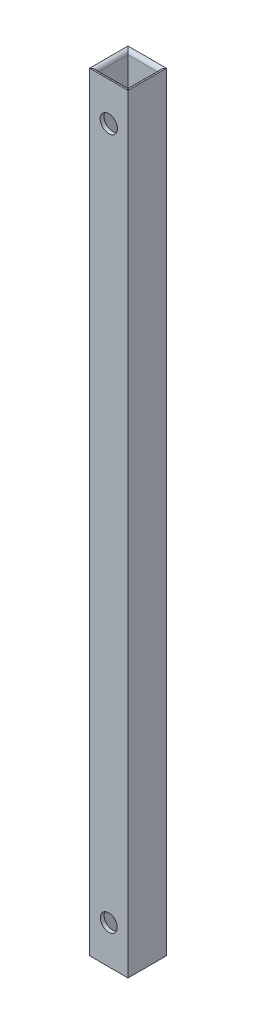
ISO-10303-21;
HEADER;
FILE_DESCRIPTION(('STEP AP214'),'2;1');
FILE_NAME('part.step','',(''),(''),'','','');
FILE_SCHEMA(('AUTOMOTIVE_DESIGN { 1 0 10303 214 1 1 1 1 }'));
ENDSEC;
DATA;
#1=APPLICATION_CONTEXT('core data for automotive mechanical design processes');
#2=APPLICATION_PROTOCOL_DEFINITION('international standard','automotive_design',2000,#1);
#3=PRODUCT_CONTEXT('',#1,'mechanical');
#4=PRODUCT('Part','Part','',(#3));
#5=PRODUCT_RELATED_PRODUCT_CATEGORY('part','',(#4));
#6=PRODUCT_DEFINITION_FORMATION('','',#4);
#7=PRODUCT_DEFINITION_CONTEXT('part definition',#1,'design');
#8=PRODUCT_DEFINITION('design','',#6,#7);
#9=PRODUCT_DEFINITION_SHAPE('','',#8);
#10=(LENGTH_UNIT() NAMED_UNIT(*) SI_UNIT(.MILLI.,.METRE.));
#11=(NAMED_UNIT(*) PLANE_ANGLE_UNIT() SI_UNIT($,.RADIAN.));
#12=(NAMED_UNIT(*) SI_UNIT($,.STERADIAN.) SOLID_ANGLE_UNIT());
#13=UNCERTAINTY_MEASURE_WITH_UNIT(LENGTH_MEASURE(1.E-05),#10,'distance_accuracy_value','');
#14=(GEOMETRIC_REPRESENTATION_CONTEXT(3) GLOBAL_UNCERTAINTY_ASSIGNED_CONTEXT((#13)) GLOBAL_UNIT_ASSIGNED_CONTEXT((#10,
#11,#12)) REPRESENTATION_CONTEXT('',''));
#15=CARTESIAN_POINT('',(0.,0.,0.));
#16=DIRECTION('',(0.,0.,1.));
#17=DIRECTION('',(1.,0.,0.));
#18=AXIS2_PLACEMENT_3D('',#15,#16,#17);
#19=CARTESIAN_POINT('',(5.,200.,-5.));
#20=DIRECTION('',(-1.,0.,0.));
#21=DIRECTION('',(0.,0.,1.));
#22=AXIS2_PLACEMENT_3D('',#19,#20,#21);
#23=PLANE('',#22);
#24=DIRECTION('',(0.,0.,-1.));
#25=VECTOR('',#24,1.);
#26=CARTESIAN_POINT('',(5.,0.,-5.));
#27=LINE('',#26,#25);
#28=CARTESIAN_POINT('',(5.,0.,5.));
#29=VERTEX_POINT('',#28);
#30=CARTESIAN_POINT('',(5.,0.,-5.));
#31=VERTEX_POINT('',#30);
#32=EDGE_CURVE('E122',#29,#31,#27,.T.);
#33=ORIENTED_EDGE('',*,*,#32,.T.);
#34=DIRECTION('',(0.,-1.,0.));
#35=VECTOR('',#34,1.);
#36=CARTESIAN_POINT('',(5.,200.,-5.));
#37=LINE('',#36,#35);
#38=CARTESIAN_POINT('',(5.,200.,-5.));
#39=VERTEX_POINT('',#38);
#40=EDGE_CURVE('E108',#39,#31,#37,.T.);
#41=ORIENTED_EDGE('',*,*,#40,.F.);
#42=DIRECTION('',(0.,0.,-1.));
#43=VECTOR('',#42,1.);
#44=CARTESIAN_POINT('',(5.,200.,-5.));
#45=LINE('',#44,#43);
#46=CARTESIAN_POINT('',(5.,200.,5.));
#47=VERTEX_POINT('',#46);
#48=EDGE_CURVE('E116',#47,#39,#45,.T.);
#49=ORIENTED_EDGE('',*,*,#48,.F.);
#50=DIRECTION('',(0.,-1.,0.));
#51=VECTOR('',#50,1.);
#52=CARTESIAN_POINT('',(5.,200.,5.));
#53=LINE('',#52,#51);
#54=EDGE_CURVE('E184',#47,#29,#53,.T.);
#55=ORIENTED_EDGE('',*,*,#54,.T.);
#56=EDGE_LOOP('',(#33,#41,#49,#55));
#57=FACE_BOUND('',#56,.T.);
#58=ADVANCED_FACE('F37',(#57),#23,.F.);
#59=CARTESIAN_POINT('',(-5.,200.,-5.));
#60=DIRECTION('',(0.,0.,1.));
#61=DIRECTION('',(1.,0.,0.));
#62=AXIS2_PLACEMENT_3D('',#59,#60,#61);
#63=PLANE('',#62);
#64=CARTESIAN_POINT('',(0.,10.,-5.));
#65=DIRECTION('',(0.,0.,1.));
#66=DIRECTION('',(1.,0.,0.));
#67=AXIS2_PLACEMENT_3D('',#64,#65,#66);
#68=CIRCLE('',#67,2.2);
#69=CARTESIAN_POINT('',(2.2,10.,-5.));
#70=VERTEX_POINT('',#69);
#71=EDGE_CURVE('E151',#70,#70,#68,.T.);
#72=ORIENTED_EDGE('',*,*,#71,.T.);
#73=EDGE_LOOP('',(#72));
#74=FACE_BOUND('',#73,.T.);
#75=CARTESIAN_POINT('',(0.,190.,-5.));
#76=DIRECTION('',(0.,0.,1.));
#77=DIRECTION('',(1.,0.,0.));
#78=AXIS2_PLACEMENT_3D('',#75,#76,#77);
#79=CIRCLE('',#78,2.25);
#80=CARTESIAN_POINT('',(2.25,190.,-5.));
#81=VERTEX_POINT('',#80);
#82=EDGE_CURVE('E167',#81,#81,#79,.T.);
#83=ORIENTED_EDGE('',*,*,#82,.T.);
#84=EDGE_LOOP('',(#83));
#85=FACE_BOUND('',#84,.T.);
#86=DIRECTION('',(-1.,0.,0.));
#87=VECTOR('',#86,1.);
#88=CARTESIAN_POINT('',(-5.,0.,-5.));
#89=LINE('',#88,#87);
#90=CARTESIAN_POINT('',(-5.,0.,-5.));
#91=VERTEX_POINT('',#90);
#92=EDGE_CURVE('E186',#31,#91,#89,.T.);
#93=ORIENTED_EDGE('',*,*,#92,.T.);
#94=DIRECTION('',(0.,-1.,0.));
#95=VECTOR('',#94,1.);
#96=CARTESIAN_POINT('',(-5.,200.,-5.));
#97=LINE('',#96,#95);
#98=CARTESIAN_POINT('',(-5.,200.,-5.));
#99=VERTEX_POINT('',#98);
#100=EDGE_CURVE('E111',#99,#91,#97,.T.);
#101=ORIENTED_EDGE('',*,*,#100,.F.);
#102=DIRECTION('',(-1.,0.,0.));
#103=VECTOR('',#102,1.);
#104=CARTESIAN_POINT('',(-5.,200.,-5.));
#105=LINE('',#104,#103);
#106=EDGE_CURVE('E105',#39,#99,#105,.T.);
#107=ORIENTED_EDGE('',*,*,#106,.F.);
#108=ORIENTED_EDGE('',*,*,#40,.T.);
#109=EDGE_LOOP('',(#93,#101,#107,#108));
#110=FACE_BOUND('',#109,.T.);
#111=ADVANCED_FACE('F107',(#74,#85,#110),#63,.F.);
#112=CARTESIAN_POINT('',(-5.,200.,-5.));
#113=DIRECTION('',(1.,0.,0.));
#114=DIRECTION('',(0.,0.,-1.));
#115=AXIS2_PLACEMENT_3D('',#112,#113,#114);
#116=PLANE('',#115);
#117=DIRECTION('',(0.,0.,1.));
#118=VECTOR('',#117,1.);
#119=CARTESIAN_POINT('',(-5.,0.,-5.));
#120=LINE('',#119,#118);
#121=CARTESIAN_POINT('',(-5.,0.,5.));
#122=VERTEX_POINT('',#121);
#123=EDGE_CURVE('E188',#91,#122,#120,.T.);
#124=ORIENTED_EDGE('',*,*,#123,.T.);
#125=DIRECTION('',(0.,-1.,0.));
#126=VECTOR('',#125,1.);
#127=CARTESIAN_POINT('',(-5.,200.,5.));
#128=LINE('',#127,#126);
#129=CARTESIAN_POINT('',(-5.,200.,5.));
#130=VERTEX_POINT('',#129);
#131=EDGE_CURVE('E193',#130,#122,#128,.T.);
#132=ORIENTED_EDGE('',*,*,#131,.F.);
#133=DIRECTION('',(0.,0.,1.));
#134=VECTOR('',#133,1.);
#135=CARTESIAN_POINT('',(-5.,200.,-5.));
#136=LINE('',#135,#134);
#137=EDGE_CURVE('E115',#99,#130,#136,.T.);
#138=ORIENTED_EDGE('',*,*,#137,.F.);
#139=ORIENTED_EDGE('',*,*,#100,.T.);
#140=EDGE_LOOP('',(#124,#132,#138,#139));
#141=FACE_BOUND('',#140,.T.);
#142=ADVANCED_FACE('F247',(#141),#116,.F.);
#143=CARTESIAN_POINT('',(-5.,200.,5.));
#144=DIRECTION('',(0.,0.,-1.));
#145=DIRECTION('',(-1.,0.,0.));
#146=AXIS2_PLACEMENT_3D('',#143,#144,#145);
#147=PLANE('',#146);
#148=CARTESIAN_POINT('',(0.,10.,5.));
#149=DIRECTION('',(0.,0.,1.));
#150=DIRECTION('',(1.,0.,0.));
#151=AXIS2_PLACEMENT_3D('',#148,#149,#150);
#152=CIRCLE('',#151,2.2);
#153=CARTESIAN_POINT('',(2.2,10.,5.));
#154=VERTEX_POINT('',#153);
#155=EDGE_CURVE('E157',#154,#154,#152,.T.);
#156=ORIENTED_EDGE('',*,*,#155,.F.);
#157=EDGE_LOOP('',(#156));
#158=FACE_BOUND('',#157,.T.);
#159=CARTESIAN_POINT('',(0.,190.,5.));
#160=DIRECTION('',(0.,0.,1.));
#161=DIRECTION('',(1.,0.,0.));
#162=AXIS2_PLACEMENT_3D('',#159,#160,#161);
#163=CIRCLE('',#162,2.25);
#164=CARTESIAN_POINT('',(2.25,190.,5.));
#165=VERTEX_POINT('',#164);
#166=EDGE_CURVE('E162',#165,#165,#163,.T.);
#167=ORIENTED_EDGE('',*,*,#166,.F.);
#168=EDGE_LOOP('',(#167));
#169=FACE_BOUND('',#168,.T.);
#170=DIRECTION('',(1.,0.,0.));
#171=VECTOR('',#170,1.);
#172=CARTESIAN_POINT('',(-5.,0.,5.));
#173=LINE('',#172,#171);
#174=EDGE_CURVE('E130',#122,#29,#173,.T.);
#175=ORIENTED_EDGE('',*,*,#174,.T.);
#176=ORIENTED_EDGE('',*,*,#54,.F.);
#177=DIRECTION('',(1.,0.,0.));
#178=VECTOR('',#177,1.);
#179=CARTESIAN_POINT('',(-5.,200.,5.));
#180=LINE('',#179,#178);
#181=EDGE_CURVE('E182',#130,#47,#180,.T.);
#182=ORIENTED_EDGE('',*,*,#181,.F.);
#183=ORIENTED_EDGE('',*,*,#131,.T.);
#184=EDGE_LOOP('',(#175,#176,#182,#183));
#185=FACE_BOUND('',#184,.T.);
#186=ADVANCED_FACE('F250',(#158,#169,#185),#147,.F.);
#187=CARTESIAN_POINT('',(4.,200.,-4.));
#188=DIRECTION('',(-1.,0.,0.));
#189=DIRECTION('',(0.,0.,1.));
#190=AXIS2_PLACEMENT_3D('',#187,#188,#189);
#191=PLANE('',#190);
#192=DIRECTION('',(0.,-1.,0.));
#193=VECTOR('',#192,1.);
#194=CARTESIAN_POINT('',(4.,200.,-4.));
#195=LINE('',#194,#193);
#196=CARTESIAN_POINT('',(4.,199.,-4.));
#197=VERTEX_POINT('',#196);
#198=CARTESIAN_POINT('',(4.,1.,-4.));
#199=VERTEX_POINT('',#198);
#200=EDGE_CURVE('E178',#197,#199,#195,.T.);
#201=ORIENTED_EDGE('',*,*,#200,.T.);
#202=DIRECTION('',(0.,0.,-1.));
#203=VECTOR('',#202,1.);
#204=CARTESIAN_POINT('',(4.,1.,4.));
#205=LINE('',#204,#203);
#206=CARTESIAN_POINT('',(4.,1.,4.));
#207=VERTEX_POINT('',#206);
#208=EDGE_CURVE('E207',#199,#207,#205,.F.);
#209=ORIENTED_EDGE('',*,*,#208,.T.);
#210=DIRECTION('',(0.,-1.,0.));
#211=VECTOR('',#210,1.);
#212=CARTESIAN_POINT('',(4.,200.,4.));
#213=LINE('',#212,#211);
#214=CARTESIAN_POINT('',(4.,199.,4.));
#215=VERTEX_POINT('',#214);
#216=EDGE_CURVE('E170',#215,#207,#213,.T.);
#217=ORIENTED_EDGE('',*,*,#216,.F.);
#218=DIRECTION('',(0.,0.,-1.));
#219=VECTOR('',#218,1.);
#220=CARTESIAN_POINT('',(4.,199.,-4.));
#221=LINE('',#220,#219);
#222=EDGE_CURVE('E205',#215,#197,#221,.T.);
#223=ORIENTED_EDGE('',*,*,#222,.T.);
#224=EDGE_LOOP('',(#201,#209,#217,#223));
#225=FACE_BOUND('',#224,.T.);
#226=ADVANCED_FACE('F228',(#225),#191,.T.);
#227=CARTESIAN_POINT('',(-4.,200.,-4.));
#228=DIRECTION('',(0.,0.,1.));
#229=DIRECTION('',(1.,0.,0.));
#230=AXIS2_PLACEMENT_3D('',#227,#228,#229);
#231=PLANE('',#230);
#232=CARTESIAN_POINT('',(0.,10.,-4.));
#233=DIRECTION('',(0.,0.,1.));
#234=DIRECTION('',(1.,0.,0.));
#235=AXIS2_PLACEMENT_3D('',#232,#233,#234);
#236=CIRCLE('',#235,2.2);
#237=CARTESIAN_POINT('',(2.2,10.,-4.));
#238=VERTEX_POINT('',#237);
#239=EDGE_CURVE('E134',#238,#238,#236,.T.);
#240=ORIENTED_EDGE('',*,*,#239,.F.);
#241=EDGE_LOOP('',(#240));
#242=FACE_BOUND('',#241,.T.);
#243=CARTESIAN_POINT('',(0.,190.,-4.));
#244=DIRECTION('',(0.,0.,1.));
#245=DIRECTION('',(1.,0.,0.));
#246=AXIS2_PLACEMENT_3D('',#243,#244,#245);
#247=CIRCLE('',#246,2.25);
#248=CARTESIAN_POINT('',(2.25,190.,-4.));
#249=VERTEX_POINT('',#248);
#250=EDGE_CURVE('E150',#249,#249,#247,.T.);
#251=ORIENTED_EDGE('',*,*,#250,.F.);
#252=EDGE_LOOP('',(#251));
#253=FACE_BOUND('',#252,.T.);
#254=DIRECTION('',(0.,-1.,0.));
#255=VECTOR('',#254,1.);
#256=CARTESIAN_POINT('',(-4.,200.,-4.));
#257=LINE('',#256,#255);
#258=CARTESIAN_POINT('',(-4.,199.,-4.));
#259=VERTEX_POINT('',#258);
#260=CARTESIAN_POINT('',(-4.,1.,-4.));
#261=VERTEX_POINT('',#260);
#262=EDGE_CURVE('E176',#259,#261,#257,.T.);
#263=ORIENTED_EDGE('',*,*,#262,.T.);
#264=DIRECTION('',(-1.,0.,0.));
#265=VECTOR('',#264,1.);
#266=CARTESIAN_POINT('',(4.,1.,-4.));
#267=LINE('',#266,#265);
#268=EDGE_CURVE('E11',#261,#199,#267,.F.);
#269=ORIENTED_EDGE('',*,*,#268,.T.);
#270=ORIENTED_EDGE('',*,*,#200,.F.);
#271=DIRECTION('',(-1.,0.,0.));
#272=VECTOR('',#271,1.);
#273=CARTESIAN_POINT('',(-4.,199.,-4.));
#274=LINE('',#273,#272);
#275=EDGE_CURVE('E46',#197,#259,#274,.T.);
#276=ORIENTED_EDGE('',*,*,#275,.T.);
#277=EDGE_LOOP('',(#263,#269,#270,#276));
#278=FACE_BOUND('',#277,.T.);
#279=ADVANCED_FACE('F238',(#242,#253,#278),#231,.T.);
#280=CARTESIAN_POINT('',(-4.,200.,-4.));
#281=DIRECTION('',(1.,0.,0.));
#282=DIRECTION('',(0.,0.,-1.));
#283=AXIS2_PLACEMENT_3D('',#280,#281,#282);
#284=PLANE('',#283);
#285=DIRECTION('',(0.,-1.,0.));
#286=VECTOR('',#285,1.);
#287=CARTESIAN_POINT('',(-4.,200.,4.));
#288=LINE('',#287,#286);
#289=CARTESIAN_POINT('',(-4.,199.,4.));
#290=VERTEX_POINT('',#289);
#291=CARTESIAN_POINT('',(-4.,1.,4.));
#292=VERTEX_POINT('',#291);
#293=EDGE_CURVE('E173',#290,#292,#288,.T.);
#294=ORIENTED_EDGE('',*,*,#293,.T.);
#295=DIRECTION('',(0.,0.,1.));
#296=VECTOR('',#295,1.);
#297=CARTESIAN_POINT('',(-4.,1.,-4.));
#298=LINE('',#297,#296);
#299=EDGE_CURVE('E198',#292,#261,#298,.F.);
#300=ORIENTED_EDGE('',*,*,#299,.T.);
#301=ORIENTED_EDGE('',*,*,#262,.F.);
#302=DIRECTION('',(0.,0.,1.));
#303=VECTOR('',#302,1.);
#304=CARTESIAN_POINT('',(-4.,199.,-4.));
#305=LINE('',#304,#303);
#306=EDGE_CURVE('E124',#259,#290,#305,.T.);
#307=ORIENTED_EDGE('',*,*,#306,.T.);
#308=EDGE_LOOP('',(#294,#300,#301,#307));
#309=FACE_BOUND('',#308,.T.);
#310=ADVANCED_FACE('F242',(#309),#284,.T.);
#311=CARTESIAN_POINT('',(-4.,200.,4.));
#312=DIRECTION('',(0.,0.,-1.));
#313=DIRECTION('',(-1.,0.,0.));
#314=AXIS2_PLACEMENT_3D('',#311,#312,#313);
#315=PLANE('',#314);
#316=CARTESIAN_POINT('',(0.,10.,4.));
#317=DIRECTION('',(0.,0.,-1.));
#318=DIRECTION('',(-1.,0.,0.));
#319=AXIS2_PLACEMENT_3D('',#316,#317,#318);
#320=CIRCLE('',#319,2.2);
#321=CARTESIAN_POINT('',(-2.2,10.,4.));
#322=VERTEX_POINT('',#321);
#323=EDGE_CURVE('E41',#322,#322,#320,.T.);
#324=ORIENTED_EDGE('',*,*,#323,.F.);
#325=EDGE_LOOP('',(#324));
#326=FACE_BOUND('',#325,.T.);
#327=CARTESIAN_POINT('',(0.,190.,4.));
#328=DIRECTION('',(0.,0.,-1.));
#329=DIRECTION('',(-1.,0.,0.));
#330=AXIS2_PLACEMENT_3D('',#327,#328,#329);
#331=CIRCLE('',#330,2.25);
#332=CARTESIAN_POINT('',(-2.25,190.,4.));
#333=VERTEX_POINT('',#332);
#334=EDGE_CURVE('E148',#333,#333,#331,.T.);
#335=ORIENTED_EDGE('',*,*,#334,.F.);
#336=EDGE_LOOP('',(#335));
#337=FACE_BOUND('',#336,.T.);
#338=ORIENTED_EDGE('',*,*,#216,.T.);
#339=DIRECTION('',(1.,0.,0.));
#340=VECTOR('',#339,1.);
#341=CARTESIAN_POINT('',(-4.,1.,4.));
#342=LINE('',#341,#340);
#343=EDGE_CURVE('E203',#207,#292,#342,.F.);
#344=ORIENTED_EDGE('',*,*,#343,.T.);
#345=ORIENTED_EDGE('',*,*,#293,.F.);
#346=DIRECTION('',(1.,0.,0.));
#347=VECTOR('',#346,1.);
#348=CARTESIAN_POINT('',(-4.,199.,4.));
#349=LINE('',#348,#347);
#350=EDGE_CURVE('E201',#290,#215,#349,.T.);
#351=ORIENTED_EDGE('',*,*,#350,.T.);
#352=EDGE_LOOP('',(#338,#344,#345,#351));
#353=FACE_BOUND('',#352,.T.);
#354=ADVANCED_FACE('F230',(#326,#337,#353),#315,.T.);
#355=CARTESIAN_POINT('',(5.,1.,0.));
#356=DIRECTION('',(0.,0.,1.));
#357=DIRECTION('',(1.,0.,0.));
#358=AXIS2_PLACEMENT_3D('',#355,#356,#357);
#359=CYLINDRICAL_SURFACE('',#358,1.);
#360=CARTESIAN_POINT('',(5.,1.,5.));
#361=DIRECTION('',(-0.707106781186547,0.,0.707106781186548));
#362=DIRECTION('',(-0.707106781186547,0.,-0.707106781186547));
#363=AXIS2_PLACEMENT_3D('',#360,#361,#362);
#364=ELLIPSE('',#363,1.4142135623731,1.);
#365=EDGE_CURVE('E212',#207,#29,#364,.T.);
#366=ORIENTED_EDGE('',*,*,#365,.F.);
#367=ORIENTED_EDGE('',*,*,#208,.F.);
#368=CARTESIAN_POINT('',(5.,1.,-5.));
#369=DIRECTION('',(0.707106781186547,0.,0.707106781186547));
#370=DIRECTION('',(-0.707106781186547,0.,0.707106781186548));
#371=AXIS2_PLACEMENT_3D('',#368,#369,#370);
#372=ELLIPSE('',#371,1.41421356237309,1.);
#373=EDGE_CURVE('E141',#31,#199,#372,.F.);
#374=ORIENTED_EDGE('',*,*,#373,.F.);
#375=ORIENTED_EDGE('',*,*,#32,.F.);
#376=EDGE_LOOP('',(#366,#367,#374,#375));
#377=FACE_BOUND('',#376,.T.);
#378=ADVANCED_FACE('F225',(#377),#359,.T.);
#379=CARTESIAN_POINT('',(0.,1.,-5.));
#380=DIRECTION('',(1.,0.,0.));
#381=DIRECTION('',(0.,0.,-1.));
#382=AXIS2_PLACEMENT_3D('',#379,#380,#381);
#383=CYLINDRICAL_SURFACE('',#382,1.);
#384=ORIENTED_EDGE('',*,*,#373,.T.);
#385=ORIENTED_EDGE('',*,*,#268,.F.);
#386=CARTESIAN_POINT('',(-5.,1.,-5.));
#387=DIRECTION('',(0.707106781186547,0.,-0.707106781186547));
#388=DIRECTION('',(-0.707106781186547,0.,-0.707106781186547));
#389=AXIS2_PLACEMENT_3D('',#386,#387,#388);
#390=ELLIPSE('',#389,1.41421356237309,1.);
#391=EDGE_CURVE('E211',#91,#261,#390,.F.);
#392=ORIENTED_EDGE('',*,*,#391,.F.);
#393=ORIENTED_EDGE('',*,*,#92,.F.);
#394=EDGE_LOOP('',(#384,#385,#392,#393));
#395=FACE_BOUND('',#394,.T.);
#396=ADVANCED_FACE('F221',(#395),#383,.T.);
#397=CARTESIAN_POINT('',(0.,1.,5.));
#398=DIRECTION('',(-1.,0.,0.));
#399=DIRECTION('',(0.,0.,1.));
#400=AXIS2_PLACEMENT_3D('',#397,#398,#399);
#401=CYLINDRICAL_SURFACE('',#400,1.);
#402=ORIENTED_EDGE('',*,*,#365,.T.);
#403=ORIENTED_EDGE('',*,*,#174,.F.);
#404=CARTESIAN_POINT('',(-5.,1.,5.));
#405=DIRECTION('',(-0.707106781186547,0.,-0.707106781186547));
#406=DIRECTION('',(0.707106781186547,0.,-0.707106781186547));
#407=AXIS2_PLACEMENT_3D('',#404,#405,#406);
#408=ELLIPSE('',#407,1.41421356237309,1.);
#409=EDGE_CURVE('E147',#292,#122,#408,.T.);
#410=ORIENTED_EDGE('',*,*,#409,.F.);
#411=ORIENTED_EDGE('',*,*,#343,.F.);
#412=EDGE_LOOP('',(#402,#403,#410,#411));
#413=FACE_BOUND('',#412,.T.);
#414=ADVANCED_FACE('F252',(#413),#401,.T.);
#415=CARTESIAN_POINT('',(-5.,1.,0.));
#416=DIRECTION('',(0.,0.,-1.));
#417=DIRECTION('',(-1.,0.,0.));
#418=AXIS2_PLACEMENT_3D('',#415,#416,#417);
#419=CYLINDRICAL_SURFACE('',#418,1.);
#420=ORIENTED_EDGE('',*,*,#391,.T.);
#421=ORIENTED_EDGE('',*,*,#299,.F.);
#422=ORIENTED_EDGE('',*,*,#409,.T.);
#423=ORIENTED_EDGE('',*,*,#123,.F.);
#424=EDGE_LOOP('',(#420,#421,#422,#423));
#425=FACE_BOUND('',#424,.T.);
#426=ADVANCED_FACE('F254',(#425),#419,.T.);
#427=CARTESIAN_POINT('',(-5.,199.,-4.));
#428=DIRECTION('',(0.,0.,1.));
#429=DIRECTION('',(1.,0.,0.));
#430=AXIS2_PLACEMENT_3D('',#427,#428,#429);
#431=CYLINDRICAL_SURFACE('',#430,1.);
#432=CARTESIAN_POINT('',(-5.,199.,-5.));
#433=DIRECTION('',(-0.707106781186547,0.,0.707106781186547));
#434=DIRECTION('',(-0.707106781186547,0.,-0.707106781186547));
#435=AXIS2_PLACEMENT_3D('',#432,#433,#434);
#436=ELLIPSE('',#435,1.41421356237309,1.);
#437=EDGE_CURVE('E136',#99,#259,#436,.F.);
#438=ORIENTED_EDGE('',*,*,#437,.F.);
#439=ORIENTED_EDGE('',*,*,#137,.T.);
#440=CARTESIAN_POINT('',(-5.,199.,5.));
#441=DIRECTION('',(0.707106781186547,0.,0.707106781186547));
#442=DIRECTION('',(-0.707106781186547,0.,0.707106781186547));
#443=AXIS2_PLACEMENT_3D('',#440,#441,#442);
#444=ELLIPSE('',#443,1.41421356237309,1.);
#445=EDGE_CURVE('E145',#290,#130,#444,.T.);
#446=ORIENTED_EDGE('',*,*,#445,.F.);
#447=ORIENTED_EDGE('',*,*,#306,.F.);
#448=EDGE_LOOP('',(#438,#439,#446,#447));
#449=FACE_BOUND('',#448,.T.);
#450=ADVANCED_FACE('F39',(#449),#431,.T.);
#451=CARTESIAN_POINT('',(-4.,199.,5.));
#452=DIRECTION('',(1.,0.,0.));
#453=DIRECTION('',(0.,0.,-1.));
#454=AXIS2_PLACEMENT_3D('',#451,#452,#453);
#455=CYLINDRICAL_SURFACE('',#454,1.);
#456=ORIENTED_EDGE('',*,*,#445,.T.);
#457=ORIENTED_EDGE('',*,*,#181,.T.);
#458=CARTESIAN_POINT('',(5.,199.,5.));
#459=DIRECTION('',(0.707106781186547,0.,-0.707106781186548));
#460=DIRECTION('',(-0.707106781186547,0.,-0.707106781186547));
#461=AXIS2_PLACEMENT_3D('',#458,#459,#460);
#462=ELLIPSE('',#461,1.4142135623731,1.);
#463=EDGE_CURVE('E128',#215,#47,#462,.T.);
#464=ORIENTED_EDGE('',*,*,#463,.F.);
#465=ORIENTED_EDGE('',*,*,#350,.F.);
#466=EDGE_LOOP('',(#456,#457,#464,#465));
#467=FACE_BOUND('',#466,.T.);
#468=ADVANCED_FACE('F235',(#467),#455,.T.);
#469=CARTESIAN_POINT('',(-4.,199.,-5.));
#470=DIRECTION('',(-1.,0.,0.));
#471=DIRECTION('',(0.,0.,1.));
#472=AXIS2_PLACEMENT_3D('',#469,#470,#471);
#473=CYLINDRICAL_SURFACE('',#472,1.);
#474=ORIENTED_EDGE('',*,*,#437,.T.);
#475=ORIENTED_EDGE('',*,*,#275,.F.);
#476=CARTESIAN_POINT('',(5.,199.,-5.));
#477=DIRECTION('',(-0.707106781186547,0.,-0.707106781186547));
#478=DIRECTION('',(0.707106781186547,0.,-0.707106781186548));
#479=AXIS2_PLACEMENT_3D('',#476,#477,#478);
#480=ELLIPSE('',#479,1.41421356237309,1.);
#481=EDGE_CURVE('E60',#39,#197,#480,.F.);
#482=ORIENTED_EDGE('',*,*,#481,.F.);
#483=ORIENTED_EDGE('',*,*,#106,.T.);
#484=EDGE_LOOP('',(#474,#475,#482,#483));
#485=FACE_BOUND('',#484,.T.);
#486=ADVANCED_FACE('F132',(#485),#473,.T.);
#487=CARTESIAN_POINT('',(5.,199.,-4.));
#488=DIRECTION('',(0.,0.,-1.));
#489=DIRECTION('',(-1.,0.,0.));
#490=AXIS2_PLACEMENT_3D('',#487,#488,#489);
#491=CYLINDRICAL_SURFACE('',#490,1.);
#492=ORIENTED_EDGE('',*,*,#463,.T.);
#493=ORIENTED_EDGE('',*,*,#48,.T.);
#494=ORIENTED_EDGE('',*,*,#481,.T.);
#495=ORIENTED_EDGE('',*,*,#222,.F.);
#496=EDGE_LOOP('',(#492,#493,#494,#495));
#497=FACE_BOUND('',#496,.T.);
#498=ADVANCED_FACE('F126',(#497),#491,.T.);
#499=CARTESIAN_POINT('',(0.,190.,-5.));
#500=DIRECTION('',(0.,0.,1.));
#501=DIRECTION('',(1.,0.,0.));
#502=AXIS2_PLACEMENT_3D('',#499,#500,#501);
#503=CYLINDRICAL_SURFACE('',#502,2.25);
#504=ORIENTED_EDGE('',*,*,#334,.T.);
#505=EDGE_LOOP('',(#504));
#506=FACE_BOUND('',#505,.T.);
#507=ORIENTED_EDGE('',*,*,#166,.T.);
#508=EDGE_LOOP('',(#507));
#509=FACE_BOUND('',#508,.T.);
#510=ADVANCED_FACE('F284',(#506,#509),#503,.F.);
#511=CARTESIAN_POINT('',(0.,10.,-5.));
#512=DIRECTION('',(0.,0.,1.));
#513=DIRECTION('',(1.,0.,0.));
#514=AXIS2_PLACEMENT_3D('',#511,#512,#513);
#515=CYLINDRICAL_SURFACE('',#514,2.2);
#516=ORIENTED_EDGE('',*,*,#323,.T.);
#517=EDGE_LOOP('',(#516));
#518=FACE_BOUND('',#517,.T.);
#519=ORIENTED_EDGE('',*,*,#155,.T.);
#520=EDGE_LOOP('',(#519));
#521=FACE_BOUND('',#520,.T.);
#522=ADVANCED_FACE('F287',(#518,#521),#515,.F.);
#523=ORIENTED_EDGE('',*,*,#250,.T.);
#524=EDGE_LOOP('',(#523));
#525=FACE_BOUND('',#524,.T.);
#526=ORIENTED_EDGE('',*,*,#82,.F.);
#527=EDGE_LOOP('',(#526));
#528=FACE_BOUND('',#527,.T.);
#529=ADVANCED_FACE('F288',(#525,#528),#503,.F.);
#530=ORIENTED_EDGE('',*,*,#239,.T.);
#531=EDGE_LOOP('',(#530));
#532=FACE_BOUND('',#531,.T.);
#533=ORIENTED_EDGE('',*,*,#71,.F.);
#534=EDGE_LOOP('',(#533));
#535=FACE_BOUND('',#534,.T.);
#536=ADVANCED_FACE('F291',(#532,#535),#515,.F.);
#537=CLOSED_SHELL('',(#58,#111,#142,#186,#226,#279,#310,#354,#378,#396,#414,#426,#450,#468,#486,
#498,#510,#522,#529,#536));
#538=MANIFOLD_SOLID_BREP('B2',#537);
#539=ADVANCED_BREP_SHAPE_REPRESENTATION('',(#18,#538),#14);
#540=SHAPE_DEFINITION_REPRESENTATION(#9,#539);
ENDSEC;
END-ISO-10303-21;
